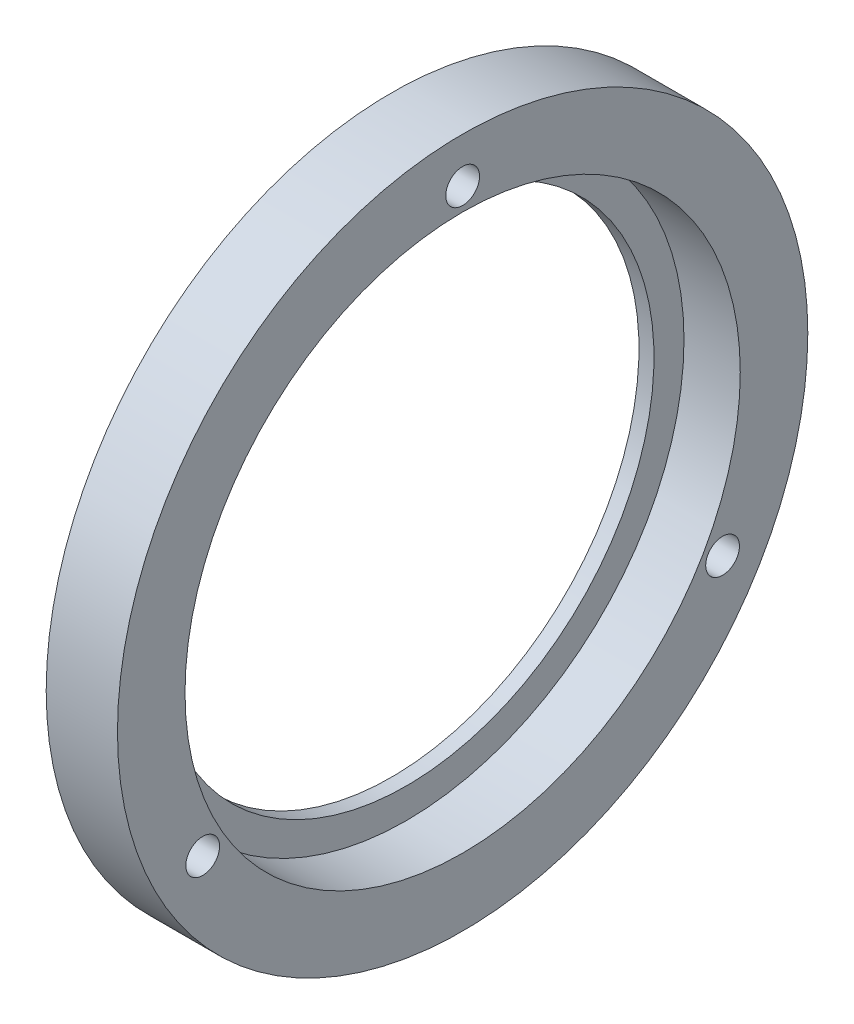
ISO-10303-21;
HEADER;
FILE_DESCRIPTION(('STEP AP214'),'2;1');
FILE_NAME('part.step','',(''),(''),'','','');
FILE_SCHEMA(('AUTOMOTIVE_DESIGN { 1 0 10303 214 1 1 1 1 }'));
ENDSEC;
DATA;
#1=APPLICATION_CONTEXT('core data for automotive mechanical design processes');
#2=APPLICATION_PROTOCOL_DEFINITION('international standard','automotive_design',2000,#1);
#3=PRODUCT_CONTEXT('',#1,'mechanical');
#4=PRODUCT('Part','Part','',(#3));
#5=PRODUCT_RELATED_PRODUCT_CATEGORY('part','',(#4));
#6=PRODUCT_DEFINITION_FORMATION('','',#4);
#7=PRODUCT_DEFINITION_CONTEXT('part definition',#1,'design');
#8=PRODUCT_DEFINITION('design','',#6,#7);
#9=PRODUCT_DEFINITION_SHAPE('','',#8);
#10=(LENGTH_UNIT() NAMED_UNIT(*) SI_UNIT(.MILLI.,.METRE.));
#11=(NAMED_UNIT(*) PLANE_ANGLE_UNIT() SI_UNIT($,.RADIAN.));
#12=(NAMED_UNIT(*) SI_UNIT($,.STERADIAN.) SOLID_ANGLE_UNIT());
#13=UNCERTAINTY_MEASURE_WITH_UNIT(LENGTH_MEASURE(1.E-05),#10,'distance_accuracy_value','');
#14=(GEOMETRIC_REPRESENTATION_CONTEXT(3) GLOBAL_UNCERTAINTY_ASSIGNED_CONTEXT((#13)) GLOBAL_UNIT_ASSIGNED_CONTEXT((#10,
#11,#12)) REPRESENTATION_CONTEXT('',''));
#15=CARTESIAN_POINT('',(0.,0.,0.));
#16=DIRECTION('',(0.,0.,1.));
#17=DIRECTION('',(1.,0.,0.));
#18=AXIS2_PLACEMENT_3D('',#15,#16,#17);
#19=CARTESIAN_POINT('',(0.,0.,0.));
#20=DIRECTION('',(-1.,0.,0.));
#21=DIRECTION('',(0.,0.,1.));
#22=AXIS2_PLACEMENT_3D('',#19,#20,#21);
#23=CYLINDRICAL_SURFACE('',#22,33.);
#24=CARTESIAN_POINT('',(0.,0.,0.));
#25=DIRECTION('',(-1.,0.,0.));
#26=DIRECTION('',(0.,0.,1.));
#27=AXIS2_PLACEMENT_3D('',#24,#25,#26);
#28=CIRCLE('',#27,33.);
#29=CARTESIAN_POINT('',(0.,0.,33.));
#30=VERTEX_POINT('',#29);
#31=EDGE_CURVE('E10',#30,#30,#28,.T.);
#32=ORIENTED_EDGE('',*,*,#31,.T.);
#33=EDGE_LOOP('',(#32));
#34=FACE_BOUND('',#33,.T.);
#35=CARTESIAN_POINT('',(2.,0.,0.));
#36=DIRECTION('',(-1.,0.,0.));
#37=DIRECTION('',(0.,0.,1.));
#38=AXIS2_PLACEMENT_3D('',#35,#36,#37);
#39=CIRCLE('',#38,33.);
#40=CARTESIAN_POINT('',(2.,0.,33.));
#41=VERTEX_POINT('',#40);
#42=EDGE_CURVE('E54',#41,#41,#39,.T.);
#43=ORIENTED_EDGE('',*,*,#42,.F.);
#44=EDGE_LOOP('',(#43));
#45=FACE_BOUND('',#44,.T.);
#46=ADVANCED_FACE('F32',(#34,#45),#23,.F.);
#47=CARTESIAN_POINT('',(-1.2490009027033E-13,33.,0.));
#48=DIRECTION('',(-1.,0.,0.));
#49=DIRECTION('',(0.,0.,1.));
#50=AXIS2_PLACEMENT_3D('',#47,#48,#49);
#51=PLANE('',#50);
#52=CARTESIAN_POINT('',(0.,-19.9999999999997,-34.6410161513777));
#53=DIRECTION('',(-1.,0.,0.));
#54=DIRECTION('',(0.,0.866025403784443,-0.499999999999992));
#55=AXIS2_PLACEMENT_3D('',#52,#53,#54);
#56=CIRCLE('',#55,2.25);
#57=CARTESIAN_POINT('',(0.,-18.0514428414847,-35.7660161513777));
#58=VERTEX_POINT('',#57);
#59=EDGE_CURVE('E72',#58,#58,#56,.T.);
#60=ORIENTED_EDGE('',*,*,#59,.F.);
#61=EDGE_LOOP('',(#60));
#62=FACE_BOUND('',#61,.T.);
#63=CARTESIAN_POINT('',(0.,-20.0000000000002,34.6410161513774));
#64=DIRECTION('',(-1.,0.,0.));
#65=DIRECTION('',(0.,-0.866025403784436,-0.500000000000004));
#66=AXIS2_PLACEMENT_3D('',#63,#64,#65);
#67=CIRCLE('',#66,2.25);
#68=CARTESIAN_POINT('',(0.,-21.9485571585151,33.5160161513774));
#69=VERTEX_POINT('',#68);
#70=EDGE_CURVE('E66',#69,#69,#67,.T.);
#71=ORIENTED_EDGE('',*,*,#70,.F.);
#72=EDGE_LOOP('',(#71));
#73=FACE_BOUND('',#72,.T.);
#74=CARTESIAN_POINT('',(0.,40.,0.));
#75=DIRECTION('',(-1.,0.,0.));
#76=DIRECTION('',(0.,0.,1.));
#77=AXIS2_PLACEMENT_3D('',#74,#75,#76);
#78=CIRCLE('',#77,2.25);
#79=CARTESIAN_POINT('',(0.,40.,2.25));
#80=VERTEX_POINT('',#79);
#81=EDGE_CURVE('E60',#80,#80,#78,.T.);
#82=ORIENTED_EDGE('',*,*,#81,.F.);
#83=EDGE_LOOP('',(#82));
#84=FACE_BOUND('',#83,.T.);
#85=CARTESIAN_POINT('',(0.,0.,0.));
#86=DIRECTION('',(-1.,0.,0.));
#87=DIRECTION('',(0.,0.,1.));
#88=AXIS2_PLACEMENT_3D('',#85,#86,#87);
#89=CIRCLE('',#88,46.);
#90=CARTESIAN_POINT('',(0.,0.,46.));
#91=VERTEX_POINT('',#90);
#92=EDGE_CURVE('E38',#91,#91,#89,.T.);
#93=ORIENTED_EDGE('',*,*,#92,.T.);
#94=EDGE_LOOP('',(#93));
#95=FACE_BOUND('',#94,.T.);
#96=ORIENTED_EDGE('',*,*,#31,.F.);
#97=EDGE_LOOP('',(#96));
#98=FACE_BOUND('',#97,.T.);
#99=ADVANCED_FACE('F78',(#62,#73,#84,#95,#98),#51,.T.);
#100=CARTESIAN_POINT('',(0.,0.,0.));
#101=DIRECTION('',(-1.,0.,0.));
#102=DIRECTION('',(0.,0.,1.));
#103=AXIS2_PLACEMENT_3D('',#100,#101,#102);
#104=CYLINDRICAL_SURFACE('',#103,46.);
#105=CARTESIAN_POINT('',(9.49999999999999,0.,0.));
#106=DIRECTION('',(-1.,0.,0.));
#107=DIRECTION('',(0.,0.,1.));
#108=AXIS2_PLACEMENT_3D('',#105,#106,#107);
#109=CIRCLE('',#108,46.);
#110=CARTESIAN_POINT('',(9.49999999999999,0.,46.));
#111=VERTEX_POINT('',#110);
#112=EDGE_CURVE('E42',#111,#111,#109,.T.);
#113=ORIENTED_EDGE('',*,*,#112,.T.);
#114=EDGE_LOOP('',(#113));
#115=FACE_BOUND('',#114,.T.);
#116=ORIENTED_EDGE('',*,*,#92,.F.);
#117=EDGE_LOOP('',(#116));
#118=FACE_BOUND('',#117,.T.);
#119=ADVANCED_FACE('F81',(#115,#118),#104,.T.);
#120=CARTESIAN_POINT('',(9.49999999999994,46.,0.));
#121=DIRECTION('',(1.,0.,0.));
#122=DIRECTION('',(0.,0.,-1.));
#123=AXIS2_PLACEMENT_3D('',#120,#121,#122);
#124=PLANE('',#123);
#125=CARTESIAN_POINT('',(9.49999999999999,-19.9999999999997,-34.6410161513777));
#126=DIRECTION('',(-1.,0.,0.));
#127=DIRECTION('',(0.,0.866025403784443,-0.499999999999992));
#128=AXIS2_PLACEMENT_3D('',#125,#126,#127);
#129=CIRCLE('',#128,2.25);
#130=CARTESIAN_POINT('',(9.49999999999999,-18.0514428414847,-35.7660161513777));
#131=VERTEX_POINT('',#130);
#132=EDGE_CURVE('E69',#131,#131,#129,.T.);
#133=ORIENTED_EDGE('',*,*,#132,.T.);
#134=EDGE_LOOP('',(#133));
#135=FACE_BOUND('',#134,.T.);
#136=CARTESIAN_POINT('',(9.5,-20.0000000000002,34.6410161513774));
#137=DIRECTION('',(-1.,0.,0.));
#138=DIRECTION('',(0.,-0.866025403784436,-0.500000000000004));
#139=AXIS2_PLACEMENT_3D('',#136,#137,#138);
#140=CIRCLE('',#139,2.25);
#141=CARTESIAN_POINT('',(9.5,-21.9485571585151,33.5160161513774));
#142=VERTEX_POINT('',#141);
#143=EDGE_CURVE('E63',#142,#142,#140,.T.);
#144=ORIENTED_EDGE('',*,*,#143,.T.);
#145=EDGE_LOOP('',(#144));
#146=FACE_BOUND('',#145,.T.);
#147=CARTESIAN_POINT('',(9.5,40.,0.));
#148=DIRECTION('',(-1.,0.,0.));
#149=DIRECTION('',(0.,0.,1.));
#150=AXIS2_PLACEMENT_3D('',#147,#148,#149);
#151=CIRCLE('',#150,2.25);
#152=CARTESIAN_POINT('',(9.5,40.,2.25));
#153=VERTEX_POINT('',#152);
#154=EDGE_CURVE('E57',#153,#153,#151,.T.);
#155=ORIENTED_EDGE('',*,*,#154,.T.);
#156=EDGE_LOOP('',(#155));
#157=FACE_BOUND('',#156,.T.);
#158=CARTESIAN_POINT('',(9.49999999999999,0.,0.));
#159=DIRECTION('',(-1.,0.,0.));
#160=DIRECTION('',(0.,0.,1.));
#161=AXIS2_PLACEMENT_3D('',#158,#159,#160);
#162=CIRCLE('',#161,37.);
#163=CARTESIAN_POINT('',(9.49999999999999,0.,37.));
#164=VERTEX_POINT('',#163);
#165=EDGE_CURVE('E46',#164,#164,#162,.T.);
#166=ORIENTED_EDGE('',*,*,#165,.T.);
#167=EDGE_LOOP('',(#166));
#168=FACE_BOUND('',#167,.T.);
#169=ORIENTED_EDGE('',*,*,#112,.F.);
#170=EDGE_LOOP('',(#169));
#171=FACE_BOUND('',#170,.T.);
#172=ADVANCED_FACE('F113',(#135,#146,#157,#168,#171),#124,.T.);
#173=CARTESIAN_POINT('',(0.,0.,0.));
#174=DIRECTION('',(-1.,0.,0.));
#175=DIRECTION('',(0.,0.,1.));
#176=AXIS2_PLACEMENT_3D('',#173,#174,#175);
#177=CYLINDRICAL_SURFACE('',#176,37.);
#178=CARTESIAN_POINT('',(2.,0.,0.));
#179=DIRECTION('',(-1.,0.,0.));
#180=DIRECTION('',(0.,0.,1.));
#181=AXIS2_PLACEMENT_3D('',#178,#179,#180);
#182=CIRCLE('',#181,37.);
#183=CARTESIAN_POINT('',(2.,0.,37.));
#184=VERTEX_POINT('',#183);
#185=EDGE_CURVE('E51',#184,#184,#182,.T.);
#186=ORIENTED_EDGE('',*,*,#185,.T.);
#187=EDGE_LOOP('',(#186));
#188=FACE_BOUND('',#187,.T.);
#189=ORIENTED_EDGE('',*,*,#165,.F.);
#190=EDGE_LOOP('',(#189));
#191=FACE_BOUND('',#190,.T.);
#192=ADVANCED_FACE('F99',(#188,#191),#177,.F.);
#193=CARTESIAN_POINT('',(1.99999999999999,37.,0.));
#194=DIRECTION('',(1.,0.,0.));
#195=DIRECTION('',(0.,0.,-1.));
#196=AXIS2_PLACEMENT_3D('',#193,#194,#195);
#197=PLANE('',#196);
#198=ORIENTED_EDGE('',*,*,#42,.T.);
#199=EDGE_LOOP('',(#198));
#200=FACE_BOUND('',#199,.T.);
#201=ORIENTED_EDGE('',*,*,#185,.F.);
#202=EDGE_LOOP('',(#201));
#203=FACE_BOUND('',#202,.T.);
#204=ADVANCED_FACE('F90',(#200,#203),#197,.T.);
#205=CARTESIAN_POINT('',(9.5,40.,0.));
#206=DIRECTION('',(-1.,0.,0.));
#207=DIRECTION('',(0.,0.,1.));
#208=AXIS2_PLACEMENT_3D('',#205,#206,#207);
#209=CYLINDRICAL_SURFACE('',#208,2.25);
#210=ORIENTED_EDGE('',*,*,#154,.F.);
#211=EDGE_LOOP('',(#210));
#212=FACE_BOUND('',#211,.T.);
#213=ORIENTED_EDGE('',*,*,#81,.T.);
#214=EDGE_LOOP('',(#213));
#215=FACE_BOUND('',#214,.T.);
#216=ADVANCED_FACE('F87',(#212,#215),#209,.F.);
#217=CARTESIAN_POINT('',(9.5,-20.0000000000002,34.6410161513774));
#218=DIRECTION('',(-1.,0.,0.));
#219=DIRECTION('',(0.,0.,1.));
#220=AXIS2_PLACEMENT_3D('',#217,#218,#219);
#221=CYLINDRICAL_SURFACE('',#220,2.25);
#222=ORIENTED_EDGE('',*,*,#143,.F.);
#223=EDGE_LOOP('',(#222));
#224=FACE_BOUND('',#223,.T.);
#225=ORIENTED_EDGE('',*,*,#70,.T.);
#226=EDGE_LOOP('',(#225));
#227=FACE_BOUND('',#226,.T.);
#228=ADVANCED_FACE('F89',(#224,#227),#221,.F.);
#229=CARTESIAN_POINT('',(9.49999999999999,-19.9999999999997,-34.6410161513777));
#230=DIRECTION('',(-1.,0.,0.));
#231=DIRECTION('',(0.,0.,1.));
#232=AXIS2_PLACEMENT_3D('',#229,#230,#231);
#233=CYLINDRICAL_SURFACE('',#232,2.25);
#234=ORIENTED_EDGE('',*,*,#132,.F.);
#235=EDGE_LOOP('',(#234));
#236=FACE_BOUND('',#235,.T.);
#237=ORIENTED_EDGE('',*,*,#59,.T.);
#238=EDGE_LOOP('',(#237));
#239=FACE_BOUND('',#238,.T.);
#240=ADVANCED_FACE('F76',(#236,#239),#233,.F.);
#241=CLOSED_SHELL('',(#46,#99,#119,#172,#192,#204,#216,#228,#240));
#242=MANIFOLD_SOLID_BREP('B2',#241);
#243=ADVANCED_BREP_SHAPE_REPRESENTATION('',(#18,#242),#14);
#244=SHAPE_DEFINITION_REPRESENTATION(#9,#243);
ENDSEC;
END-ISO-10303-21;
